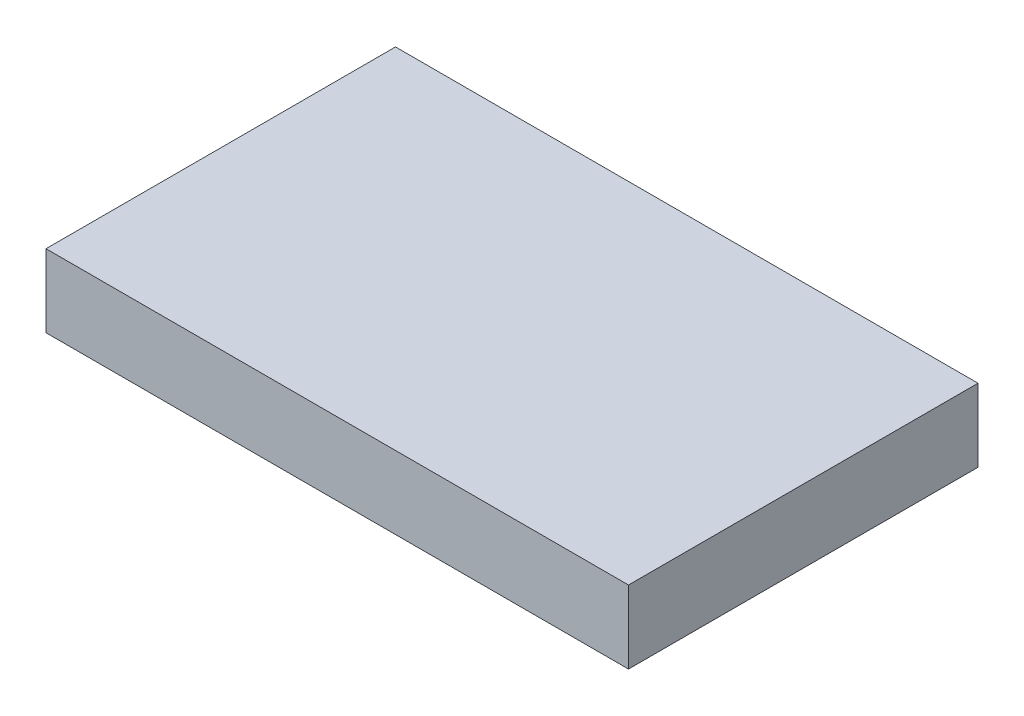
ISO-10303-21;
HEADER;
FILE_DESCRIPTION(('STEP AP214'),'2;1');
FILE_NAME('part.step','',(''),(''),'','','');
FILE_SCHEMA(('AUTOMOTIVE_DESIGN { 1 0 10303 214 1 1 1 1 }'));
ENDSEC;
DATA;
#1=APPLICATION_CONTEXT('core data for automotive mechanical design processes');
#2=APPLICATION_PROTOCOL_DEFINITION('international standard','automotive_design',2000,#1);
#3=PRODUCT_CONTEXT('',#1,'mechanical');
#4=PRODUCT('Part','Part','',(#3));
#5=PRODUCT_RELATED_PRODUCT_CATEGORY('part','',(#4));
#6=PRODUCT_DEFINITION_FORMATION('','',#4);
#7=PRODUCT_DEFINITION_CONTEXT('part definition',#1,'design');
#8=PRODUCT_DEFINITION('design','',#6,#7);
#9=PRODUCT_DEFINITION_SHAPE('','',#8);
#10=(LENGTH_UNIT() NAMED_UNIT(*) SI_UNIT(.MILLI.,.METRE.));
#11=(NAMED_UNIT(*) PLANE_ANGLE_UNIT() SI_UNIT($,.RADIAN.));
#12=(NAMED_UNIT(*) SI_UNIT($,.STERADIAN.) SOLID_ANGLE_UNIT());
#13=UNCERTAINTY_MEASURE_WITH_UNIT(LENGTH_MEASURE(1.E-05),#10,'distance_accuracy_value','');
#14=(GEOMETRIC_REPRESENTATION_CONTEXT(3) GLOBAL_UNCERTAINTY_ASSIGNED_CONTEXT((#13)) GLOBAL_UNIT_ASSIGNED_CONTEXT((#10,
#11,#12)) REPRESENTATION_CONTEXT('',''));
#15=CARTESIAN_POINT('',(0.,0.,0.));
#16=DIRECTION('',(0.,0.,1.));
#17=DIRECTION('',(1.,0.,0.));
#18=AXIS2_PLACEMENT_3D('',#15,#16,#17);
#19=CARTESIAN_POINT('',(25.4,3.175,15.24));
#20=DIRECTION('',(-1.,0.,0.));
#21=DIRECTION('',(0.,0.,1.));
#22=AXIS2_PLACEMENT_3D('',#19,#20,#21);
#23=PLANE('',#22);
#24=DIRECTION('',(0.,0.,-1.));
#25=VECTOR('',#24,1.);
#26=CARTESIAN_POINT('',(25.4,-3.175,15.24));
#27=LINE('',#26,#25);
#28=CARTESIAN_POINT('',(25.4,-3.175,15.24));
#29=VERTEX_POINT('',#28);
#30=CARTESIAN_POINT('',(25.4,-3.175,-15.24));
#31=VERTEX_POINT('',#30);
#32=EDGE_CURVE('E99',#29,#31,#27,.T.);
#33=ORIENTED_EDGE('',*,*,#32,.T.);
#34=DIRECTION('',(0.,-1.,0.));
#35=VECTOR('',#34,1.);
#36=CARTESIAN_POINT('',(25.4,3.175,-15.24));
#37=LINE('',#36,#35);
#38=CARTESIAN_POINT('',(25.4,3.175,-15.24));
#39=VERTEX_POINT('',#38);
#40=EDGE_CURVE('E11',#39,#31,#37,.T.);
#41=ORIENTED_EDGE('',*,*,#40,.F.);
#42=DIRECTION('',(0.,0.,-1.));
#43=VECTOR('',#42,1.);
#44=CARTESIAN_POINT('',(25.4,3.175,15.24));
#45=LINE('',#44,#43);
#46=CARTESIAN_POINT('',(25.4,3.175,15.24));
#47=VERTEX_POINT('',#46);
#48=EDGE_CURVE('E87',#47,#39,#45,.T.);
#49=ORIENTED_EDGE('',*,*,#48,.F.);
#50=DIRECTION('',(0.,-1.,0.));
#51=VECTOR('',#50,1.);
#52=CARTESIAN_POINT('',(25.4,3.175,15.24));
#53=LINE('',#52,#51);
#54=EDGE_CURVE('E95',#47,#29,#53,.T.);
#55=ORIENTED_EDGE('',*,*,#54,.T.);
#56=EDGE_LOOP('',(#33,#41,#49,#55));
#57=FACE_BOUND('',#56,.T.);
#58=ADVANCED_FACE('F36',(#57),#23,.F.);
#59=CARTESIAN_POINT('',(-25.4,3.175,-15.24));
#60=DIRECTION('',(0.,0.,1.));
#61=DIRECTION('',(1.,0.,0.));
#62=AXIS2_PLACEMENT_3D('',#59,#60,#61);
#63=PLANE('',#62);
#64=DIRECTION('',(-1.,0.,0.));
#65=VECTOR('',#64,1.);
#66=CARTESIAN_POINT('',(-25.4,-3.175,-15.24));
#67=LINE('',#66,#65);
#68=CARTESIAN_POINT('',(-25.4,-3.175,-15.24));
#69=VERTEX_POINT('',#68);
#70=EDGE_CURVE('E91',#31,#69,#67,.T.);
#71=ORIENTED_EDGE('',*,*,#70,.T.);
#72=DIRECTION('',(0.,-1.,0.));
#73=VECTOR('',#72,1.);
#74=CARTESIAN_POINT('',(-25.4,3.175,-15.24));
#75=LINE('',#74,#73);
#76=CARTESIAN_POINT('',(-25.4,3.175,-15.24));
#77=VERTEX_POINT('',#76);
#78=EDGE_CURVE('E44',#77,#69,#75,.T.);
#79=ORIENTED_EDGE('',*,*,#78,.F.);
#80=DIRECTION('',(-1.,0.,0.));
#81=VECTOR('',#80,1.);
#82=CARTESIAN_POINT('',(-25.4,3.175,-15.24));
#83=LINE('',#82,#81);
#84=EDGE_CURVE('E82',#39,#77,#83,.T.);
#85=ORIENTED_EDGE('',*,*,#84,.F.);
#86=ORIENTED_EDGE('',*,*,#40,.T.);
#87=EDGE_LOOP('',(#71,#79,#85,#86));
#88=FACE_BOUND('',#87,.T.);
#89=ADVANCED_FACE('F90',(#88),#63,.F.);
#90=CARTESIAN_POINT('',(-25.4,3.175,15.24));
#91=DIRECTION('',(1.,0.,0.));
#92=DIRECTION('',(0.,0.,-1.));
#93=AXIS2_PLACEMENT_3D('',#90,#91,#92);
#94=PLANE('',#93);
#95=DIRECTION('',(0.,0.,1.));
#96=VECTOR('',#95,1.);
#97=CARTESIAN_POINT('',(-25.4,-3.175,15.24));
#98=LINE('',#97,#96);
#99=CARTESIAN_POINT('',(-25.4,-3.175,15.24));
#100=VERTEX_POINT('',#99);
#101=EDGE_CURVE('E69',#69,#100,#98,.T.);
#102=ORIENTED_EDGE('',*,*,#101,.T.);
#103=DIRECTION('',(0.,-1.,0.));
#104=VECTOR('',#103,1.);
#105=CARTESIAN_POINT('',(-25.4,3.175,15.24));
#106=LINE('',#105,#104);
#107=CARTESIAN_POINT('',(-25.4,3.175,15.24));
#108=VERTEX_POINT('',#107);
#109=EDGE_CURVE('E92',#108,#100,#106,.T.);
#110=ORIENTED_EDGE('',*,*,#109,.F.);
#111=DIRECTION('',(0.,0.,1.));
#112=VECTOR('',#111,1.);
#113=CARTESIAN_POINT('',(-25.4,3.175,15.24));
#114=LINE('',#113,#112);
#115=EDGE_CURVE('E85',#77,#108,#114,.T.);
#116=ORIENTED_EDGE('',*,*,#115,.F.);
#117=ORIENTED_EDGE('',*,*,#78,.T.);
#118=EDGE_LOOP('',(#102,#110,#116,#117));
#119=FACE_BOUND('',#118,.T.);
#120=ADVANCED_FACE('F93',(#119),#94,.F.);
#121=CARTESIAN_POINT('',(-25.4,3.175,15.24));
#122=DIRECTION('',(0.,0.,-1.));
#123=DIRECTION('',(-1.,0.,0.));
#124=AXIS2_PLACEMENT_3D('',#121,#122,#123);
#125=PLANE('',#124);
#126=DIRECTION('',(1.,0.,0.));
#127=VECTOR('',#126,1.);
#128=CARTESIAN_POINT('',(-25.4,-3.175,15.24));
#129=LINE('',#128,#127);
#130=EDGE_CURVE('E75',#100,#29,#129,.T.);
#131=ORIENTED_EDGE('',*,*,#130,.T.);
#132=ORIENTED_EDGE('',*,*,#54,.F.);
#133=DIRECTION('',(1.,0.,0.));
#134=VECTOR('',#133,1.);
#135=CARTESIAN_POINT('',(-25.4,3.175,15.24));
#136=LINE('',#135,#134);
#137=EDGE_CURVE('E52',#108,#47,#136,.T.);
#138=ORIENTED_EDGE('',*,*,#137,.F.);
#139=ORIENTED_EDGE('',*,*,#109,.T.);
#140=EDGE_LOOP('',(#131,#132,#138,#139));
#141=FACE_BOUND('',#140,.T.);
#142=ADVANCED_FACE('F106',(#141),#125,.F.);
#143=CARTESIAN_POINT('',(0.,3.175,0.));
#144=DIRECTION('',(0.,-1.,0.));
#145=DIRECTION('',(0.,0.,-1.));
#146=AXIS2_PLACEMENT_3D('',#143,#144,#145);
#147=PLANE('',#146);
#148=ORIENTED_EDGE('',*,*,#48,.T.);
#149=ORIENTED_EDGE('',*,*,#84,.T.);
#150=ORIENTED_EDGE('',*,*,#115,.T.);
#151=ORIENTED_EDGE('',*,*,#137,.T.);
#152=EDGE_LOOP('',(#148,#149,#150,#151));
#153=FACE_BOUND('',#152,.T.);
#154=ADVANCED_FACE('F83',(#153),#147,.F.);
#155=CARTESIAN_POINT('',(0.,-3.175,0.));
#156=DIRECTION('',(0.,-1.,0.));
#157=DIRECTION('',(0.,0.,-1.));
#158=AXIS2_PLACEMENT_3D('',#155,#156,#157);
#159=PLANE('',#158);
#160=ORIENTED_EDGE('',*,*,#32,.F.);
#161=ORIENTED_EDGE('',*,*,#130,.F.);
#162=ORIENTED_EDGE('',*,*,#101,.F.);
#163=ORIENTED_EDGE('',*,*,#70,.F.);
#164=EDGE_LOOP('',(#160,#161,#162,#163));
#165=FACE_BOUND('',#164,.T.);
#166=ADVANCED_FACE('F109',(#165),#159,.T.);
#167=CLOSED_SHELL('',(#58,#89,#120,#142,#154,#166));
#168=MANIFOLD_SOLID_BREP('B2',#167);
#169=ADVANCED_BREP_SHAPE_REPRESENTATION('',(#18,#168),#14);
#170=SHAPE_DEFINITION_REPRESENTATION(#9,#169);
ENDSEC;
END-ISO-10303-21;
